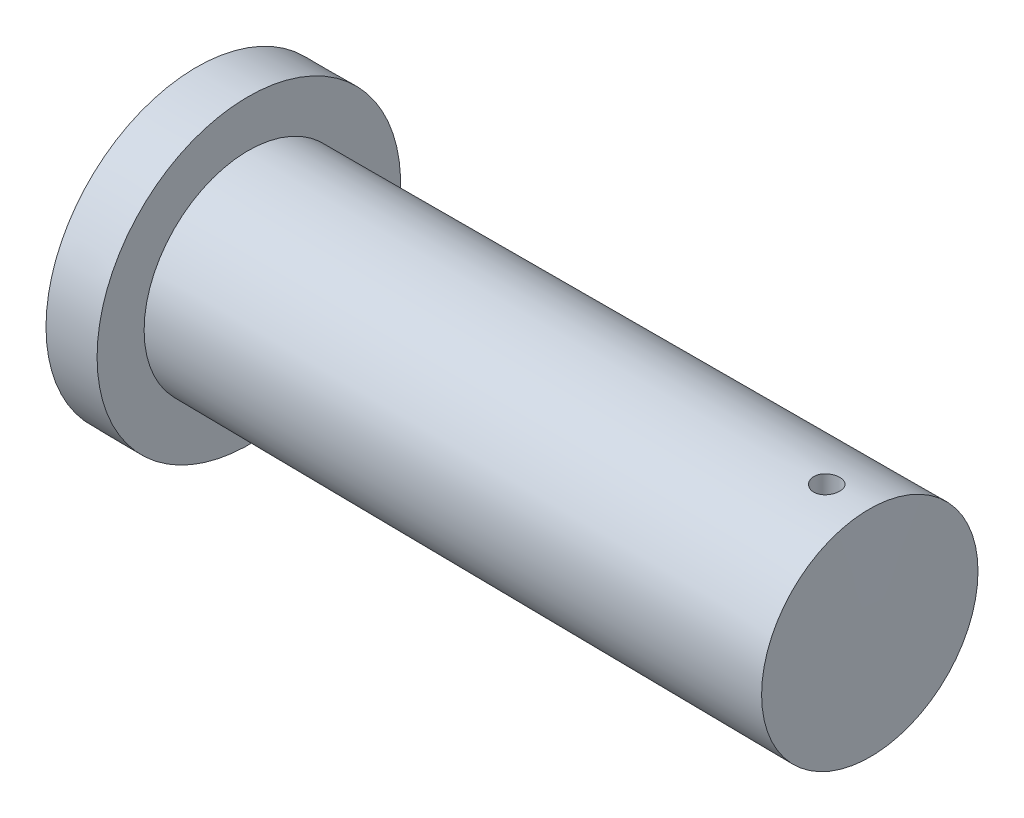
ISO-10303-21;
HEADER;
FILE_DESCRIPTION(('STEP AP214'),'2;1');
FILE_NAME('part.step','',(''),(''),'','','');
FILE_SCHEMA(('AUTOMOTIVE_DESIGN { 1 0 10303 214 1 1 1 1 }'));
ENDSEC;
DATA;
#1=APPLICATION_CONTEXT('core data for automotive mechanical design processes');
#2=APPLICATION_PROTOCOL_DEFINITION('international standard','automotive_design',2000,#1);
#3=PRODUCT_CONTEXT('',#1,'mechanical');
#4=PRODUCT('Part','Part','',(#3));
#5=PRODUCT_RELATED_PRODUCT_CATEGORY('part','',(#4));
#6=PRODUCT_DEFINITION_FORMATION('','',#4);
#7=PRODUCT_DEFINITION_CONTEXT('part definition',#1,'design');
#8=PRODUCT_DEFINITION('design','',#6,#7);
#9=PRODUCT_DEFINITION_SHAPE('','',#8);
#10=(LENGTH_UNIT() NAMED_UNIT(*) SI_UNIT(.MILLI.,.METRE.));
#11=(NAMED_UNIT(*) PLANE_ANGLE_UNIT() SI_UNIT($,.RADIAN.));
#12=(NAMED_UNIT(*) SI_UNIT($,.STERADIAN.) SOLID_ANGLE_UNIT());
#13=UNCERTAINTY_MEASURE_WITH_UNIT(LENGTH_MEASURE(1.E-05),#10,'distance_accuracy_value','');
#14=(GEOMETRIC_REPRESENTATION_CONTEXT(3) GLOBAL_UNCERTAINTY_ASSIGNED_CONTEXT((#13)) GLOBAL_UNIT_ASSIGNED_CONTEXT((#10,
#11,#12)) REPRESENTATION_CONTEXT('',''));
#15=CARTESIAN_POINT('',(0.,0.,0.));
#16=DIRECTION('',(0.,0.,1.));
#17=DIRECTION('',(1.,0.,0.));
#18=AXIS2_PLACEMENT_3D('',#15,#16,#17);
#19=CARTESIAN_POINT('',(-422.925741618143,0.,76.2880576247141));
#20=DIRECTION('',(-0.999984794635845,0.,-0.00551457134384336));
#21=DIRECTION('',(-0.00551457134384336,0.,0.999984794635845));
#22=AXIS2_PLACEMENT_3D('',#19,#20,#21);
#23=CONICAL_SURFACE('',#22,349.994678122546,1.56528172750053);
#24=CARTESIAN_POINT('',(-420.995670995671,0.,76.2987012987013));
#25=VERTEX_POINT('',#24);
#26=VERTEX_LOOP('',#25);
#27=FACE_BOUND('',#26,.T.);
#28=CARTESIAN_POINT('',(-422.925741618143,0.,76.2880576247141));
#29=DIRECTION('',(-0.999984794635845,0.,-0.00551457134384336));
#30=DIRECTION('',(-0.00551457134384336,0.,0.999984794635845));
#31=AXIS2_PLACEMENT_3D('',#28,#29,#30);
#32=CIRCLE('',#31,349.994678122546);
#33=CARTESIAN_POINT('',(-424.855812240615,0.,426.277413950727));
#34=VERTEX_POINT('',#33);
#35=EDGE_CURVE('E11',#34,#34,#32,.T.);
#36=ORIENTED_EDGE('',*,*,#35,.T.);
#37=EDGE_LOOP('',(#36));
#38=FACE_BOUND('',#37,.T.);
#39=ADVANCED_FACE('F43',(#27,#38),#23,.F.);
#40=CARTESIAN_POINT('',(-302.929390877796,0.,76.9497961238475));
#41=DIRECTION('',(0.999984794635845,0.,0.00551457134384336));
#42=DIRECTION('',(0.00551457134384336,0.,-0.999984794635845));
#43=AXIS2_PLACEMENT_3D('',#40,#41,#42);
#44=CONICAL_SURFACE('',#43,350.656426683807,0.0055145992943682);
#45=ORIENTED_EDGE('',*,*,#35,.F.);
#46=EDGE_LOOP('',(#45));
#47=FACE_BOUND('',#46,.T.);
#48=CARTESIAN_POINT('',(-302.929390877796,0.,76.9497961238475));
#49=DIRECTION('',(-0.999984794635845,0.,-0.00551457134384336));
#50=DIRECTION('',(-0.00551457134384336,0.,0.999984794635845));
#51=AXIS2_PLACEMENT_3D('',#48,#49,#50);
#52=CIRCLE('',#51,350.656426683807);
#53=CARTESIAN_POINT('',(-304.863110759921,0.,427.600890948994));
#54=VERTEX_POINT('',#53);
#55=EDGE_CURVE('E57',#54,#54,#52,.T.);
#56=ORIENTED_EDGE('',*,*,#55,.T.);
#57=EDGE_LOOP('',(#56));
#58=FACE_BOUND('',#57,.T.);
#59=ADVANCED_FACE('F66',(#47,#58),#44,.T.);
#60=CARTESIAN_POINT('',(-301.594882447724,0.,-165.04329004329));
#61=DIRECTION('',(-0.999984794635845,0.,-0.00551457134384336));
#62=DIRECTION('',(-0.00551457134384336,0.,0.999984794635845));
#63=AXIS2_PLACEMENT_3D('',#60,#61,#62);
#64=PLANE('',#63);
#65=ORIENTED_EDGE('',*,*,#55,.F.);
#66=EDGE_LOOP('',(#65));
#67=FACE_BOUND('',#66,.T.);
#68=CARTESIAN_POINT('',(-302.929390877796,0.,76.9497961238475));
#69=DIRECTION('',(-0.999984794635845,0.,-0.00551457134384336));
#70=DIRECTION('',(-0.00551457134384336,0.,0.999984794635845));
#71=AXIS2_PLACEMENT_3D('',#68,#69,#70);
#72=CIRCLE('',#71,241.996765816086);
#73=CARTESIAN_POINT('',(-304.263899307868,0.,318.942882290985));
#74=VERTEX_POINT('',#73);
#75=EDGE_CURVE('E76',#74,#74,#72,.T.);
#76=ORIENTED_EDGE('',*,*,#75,.T.);
#77=EDGE_LOOP('',(#76));
#78=FACE_BOUND('',#77,.T.);
#79=ADVANCED_FACE('F71',(#67,#78),#64,.F.);
#80=CARTESIAN_POINT('',(1147.62570713113,0.,84.9491073324333));
#81=DIRECTION('',(0.999984794635845,0.,0.00551457134384336));
#82=DIRECTION('',(0.00551457134384336,0.,-0.999984794635845));
#83=AXIS2_PLACEMENT_3D('',#80,#81,#82);
#84=CONICAL_SURFACE('',#83,249.996198658961,0.0055145992943686);
#85=CARTESIAN_POINT('',(1030.64078129818,-248.091498375832,59.2800322583241));
#86=CARTESIAN_POINT('',(1029.93428233845,-248.134547562659,59.7416354920427));
#87=CARTESIAN_POINT('',(1029.24746415687,-248.179374598095,60.2329518924908));
#88=CARTESIAN_POINT('',(1027.91754706153,-248.271249777088,61.2717942248501));
#89=CARTESIAN_POINT('',(1027.27445857254,-248.318298445764,61.8193334822415));
#90=CARTESIAN_POINT('',(1026.03613560698,-248.413240855119,62.9672035698947));
#91=CARTESIAN_POINT('',(1025.44095034355,-248.461135404751,63.5675873972236));
#92=CARTESIAN_POINT('',(1024.30335927027,-248.556291968255,64.8164195261376));
#93=CARTESIAN_POINT('',(1023.76095029683,-248.603554019893,65.4648649426515));
#94=CARTESIAN_POINT('',(1022.73288006759,-248.696030061646,66.805074594167));
#95=CARTESIAN_POINT('',(1022.24720007493,-248.741244724948,67.4968244096612));
#96=CARTESIAN_POINT('',(1021.33582728785,-248.828306206114,68.9189899788141));
#97=CARTESIAN_POINT('',(1020.91013534517,-248.870152976156,69.6494062812615));
#98=CARTESIAN_POINT('',(1020.12190435586,-248.949232148321,71.1435608711761));
#99=CARTESIAN_POINT('',(1019.7593494231,-248.986465710508,71.9072907158423));
#100=CARTESIAN_POINT('',(1019.09989338412,-249.055231739115,73.4628343664662));
#101=CARTESIAN_POINT('',(1018.80299187369,-249.086764240635,74.2546479994845));
#102=CARTESIAN_POINT('',(1018.27758299904,-249.143136537095,75.8589960811222));
#103=CARTESIAN_POINT('',(1018.04892993361,-249.167990578156,76.6714823104053));
#104=CARTESIAN_POINT('',(1017.66084564002,-249.210363627732,78.3130124355296));
#105=CARTESIAN_POINT('',(1017.50141439375,-249.227882638166,79.1420563270384));
#106=CARTESIAN_POINT('',(1017.2529574956,-249.255069391458,80.8107602211185));
#107=CARTESIAN_POINT('',(1017.16393217041,-249.264737097886,81.65042027293));
#108=CARTESIAN_POINT('',(1017.05695291063,-249.275935883188,83.3343084119552));
#109=CARTESIAN_POINT('',(1017.03899868411,-249.277466995483,84.1785364803911));
#110=CARTESIAN_POINT('',(1017.07419299005,-249.27236224424,85.8606794491351));
#111=CARTESIAN_POINT('',(1017.12693804087,-249.265772742397,86.6986029622915));
#112=CARTESIAN_POINT('',(1017.30243177813,-249.24469734746,88.3669831154871));
#113=CARTESIAN_POINT('',(1017.42518017946,-249.230211486526,89.197439785923));
#114=CARTESIAN_POINT('',(1017.73977455074,-249.193765609541,90.8449895018706));
#115=CARTESIAN_POINT('',(1017.9316203917,-249.171805607443,91.6620825723252));
#116=CARTESIAN_POINT('',(1018.38300520701,-249.121050802172,93.2771333933515));
#117=CARTESIAN_POINT('',(1018.64254432868,-249.092255984125,94.0750911022767));
#118=CARTESIAN_POINT('',(1019.22753435084,-249.028657967472,95.6465342791937));
#119=CARTESIAN_POINT('',(1019.55300807836,-248.99385268862,96.4200111642299));
#120=CARTESIAN_POINT('',(1020.2674734141,-248.919252710075,97.9367959894713));
#121=CARTESIAN_POINT('',(1020.65646499669,-248.879458012397,98.6801039418527));
#122=CARTESIAN_POINT('',(1021.49521567101,-248.796034758187,100.131407510633));
#123=CARTESIAN_POINT('',(1021.94497664785,-248.752406082738,100.839402030654));
#124=CARTESIAN_POINT('',(1022.90209432888,-248.662585346613,102.215154847148));
#125=CARTESIAN_POINT('',(1023.40945130303,-248.616393273923,102.882912955003));
#126=CARTESIAN_POINT('',(1024.48132929836,-248.522520958361,104.177328817997));
#127=CARTESIAN_POINT('',(1025.04616525248,-248.474833629669,104.803725299968));
#128=CARTESIAN_POINT('',(1026.22656476285,-248.379641463772,106.006762602422));
#129=CARTESIAN_POINT('',(1026.84212851791,-248.332136627283,106.583403227887));
#130=CARTESIAN_POINT('',(1028.11969033144,-248.238725134585,107.68288818484));
#131=CARTESIAN_POINT('',(1028.78168911161,-248.192818503232,108.205731679885));
#132=CARTESIAN_POINT('',(1030.1474858492,-248.103984927067,109.193917517247));
#133=CARTESIAN_POINT('',(1030.85128379543,-248.061057981457,109.659259874957));
#134=CARTESIAN_POINT('',(1032.29719115775,-247.979408420471,110.529995649238));
#135=CARTESIAN_POINT('',(1033.03937415724,-247.940694357811,110.935267697125));
#136=CARTESIAN_POINT('',(1034.55551489684,-247.868769615277,111.681823497928));
#137=CARTESIAN_POINT('',(1035.32947270055,-247.835558946419,112.023107122758));
#138=CARTESIAN_POINT('',(1036.90363520308,-247.775692981695,112.639183372277));
#139=CARTESIAN_POINT('',(1037.70383907881,-247.749037480481,112.913978079813));
#140=CARTESIAN_POINT('',(1039.32478847122,-247.703149126179,113.395063292955));
#141=CARTESIAN_POINT('',(1040.14553387964,-247.683916233986,113.601354159476));
#142=CARTESIAN_POINT('',(1041.79725661948,-247.653611447003,113.942991492958));
#143=CARTESIAN_POINT('',(1042.62815641597,-247.642496733746,114.078709081566));
#144=CARTESIAN_POINT('',(1044.29848987619,-247.628680828734,114.279854357403));
#145=CARTESIAN_POINT('',(1045.1379235113,-247.625979608763,114.345282280374));
#146=CARTESIAN_POINT('',(1046.8192808831,-247.629167604216,114.40537142657));
#147=CARTESIAN_POINT('',(1047.66120455353,-247.635056593069,114.400034516242));
#148=CARTESIAN_POINT('',(1049.3415227488,-247.655353027771,114.318651943578));
#149=CARTESIAN_POINT('',(1050.17991728017,-247.669760457821,114.242606412401));
#150=CARTESIAN_POINT('',(1051.84354606035,-247.706694766139,114.020872069076));
#151=CARTESIAN_POINT('',(1052.66882168573,-247.729186060822,113.875487570516));
#152=CARTESIAN_POINT('',(1054.30409131416,-247.781750081684,113.516282791883));
#153=CARTESIAN_POINT('',(1055.11408537122,-247.811822781068,113.302462753696));
#154=CARTESIAN_POINT('',(1056.71312000746,-247.878787735737,112.80795147778));
#155=CARTESIAN_POINT('',(1057.50216019757,-247.915680117547,112.527258999347));
#156=CARTESIAN_POINT('',(1059.0537708775,-247.995329667643,111.901037073139));
#157=CARTESIAN_POINT('',(1059.81634124678,-248.038086862631,111.555507330169));
#158=CARTESIAN_POINT('',(1061.31252534252,-248.128517343465,110.800667844741));
#159=CARTESIAN_POINT('',(1062.04601992733,-248.176208440927,110.391124085264));
#160=CARTESIAN_POINT('',(1063.47592476438,-248.275110065829,109.512110973387));
#161=CARTESIAN_POINT('',(1064.1723349441,-248.326320600153,109.042641503812));
#162=CARTESIAN_POINT('',(1065.52328044797,-248.430902372655,108.047057581485));
#163=CARTESIAN_POINT('',(1066.17781422502,-248.484273690545,107.520941037861));
#164=CARTESIAN_POINT('',(1067.44045836778,-248.591754268786,106.415741006521));
#165=CARTESIAN_POINT('',(1068.04856854483,-248.645863532135,105.836657303578));
#166=CARTESIAN_POINT('',(1069.21785492268,-248.753717838517,104.625698972567));
#167=CARTESIAN_POINT('',(1069.77870881617,-248.807458391622,103.993512675055));
#168=CARTESIAN_POINT('',(1070.84518337298,-248.912769863984,102.683978430597));
#169=CARTESIAN_POINT('',(1071.35080377975,-248.964340773164,102.006630273907));
#170=CARTESIAN_POINT('',(1072.30321483795,-249.063912405769,100.611514892394));
#171=CARTESIAN_POINT('',(1072.75000556593,-249.11191313384,99.8937477201627));
#172=CARTESIAN_POINT('',(1073.58154645862,-249.203036474218,98.4228365727182));
#173=CARTESIAN_POINT('',(1073.96629679835,-249.246159100285,97.6696926973033));
#174=CARTESIAN_POINT('',(1074.67066777125,-249.326313607545,96.1339849934263));
#175=CARTESIAN_POINT('',(1074.99034224225,-249.363350518568,95.3514461238688));
#176=CARTESIAN_POINT('',(1075.56261289402,-249.43036164044,93.7619160740833));
#177=CARTESIAN_POINT('',(1075.81520906062,-249.460335849798,92.9549248886932));
#178=CARTESIAN_POINT('',(1076.2514365451,-249.512395643511,91.3222953208147));
#179=CARTESIAN_POINT('',(1076.4350705641,-249.534481536838,90.4966576700242));
#180=CARTESIAN_POINT('',(1076.73200886937,-249.570156465922,88.832650679698));
#181=CARTESIAN_POINT('',(1076.84531355695,-249.583745550166,87.9942814128436));
#182=CARTESIAN_POINT('',(1077.00020088114,-249.601987744388,86.3167098428134));
#183=CARTESIAN_POINT('',(1077.042274935,-249.606702106217,85.477553544102));
#184=CARTESIAN_POINT('',(1077.05591006071,-249.607252238743,83.7986676360259));
#185=CARTESIAN_POINT('',(1077.02747146491,-249.603088051288,82.9589380293821));
#186=CARTESIAN_POINT('',(1076.90029736748,-249.585995049678,81.2849257311326));
#187=CARTESIAN_POINT('',(1076.80156313099,-249.573066393262,80.4506429417705));
#188=CARTESIAN_POINT('',(1076.5345373585,-249.538797464177,78.7934608765041));
#189=CARTESIAN_POINT('',(1076.36624581701,-249.517457190845,77.9705616014974));
#190=CARTESIAN_POINT('',(1075.96188685681,-249.467012621724,76.3441326684194));
#191=CARTESIAN_POINT('',(1075.72599860121,-249.437928864075,75.5405578152721));
#192=CARTESIAN_POINT('',(1075.18799719003,-249.372757492473,73.956189780416));
#193=CARTESIAN_POINT('',(1074.88588420373,-249.336669896425,73.1753965404762));
#194=CARTESIAN_POINT('',(1074.21760523928,-249.258460424853,71.6420101418925));
#195=CARTESIAN_POINT('',(1073.85143735423,-249.216338369692,70.8894178235921));
#196=CARTESIAN_POINT('',(1073.05766603795,-249.127189400836,69.4176650226168));
#197=CARTESIAN_POINT('',(1072.63006227043,-249.080162460292,68.6985047229714));
#198=CARTESIAN_POINT('',(1071.71387725931,-248.982185798825,67.2946527068707));
#199=CARTESIAN_POINT('',(1071.224968521,-248.931215619518,66.6101761364654));
#200=CARTESIAN_POINT('',(1070.19151992119,-248.826955870301,65.2847833685104));
#201=CARTESIAN_POINT('',(1069.64697987307,-248.773666292611,64.6438673171025));
#202=CARTESIAN_POINT('',(1068.50605440735,-248.666195346177,63.4100138703289));
#203=CARTESIAN_POINT('',(1067.90966719609,-248.612013946634,62.8170781362131));
#204=CARTESIAN_POINT('',(1066.6692068153,-248.504211194537,61.6833253069914));
#205=CARTESIAN_POINT('',(1066.02513351324,-248.450589843541,61.1425083567621));
#206=CARTESIAN_POINT('',(1064.69009729621,-248.345049801726,60.1139440854836));
#207=CARTESIAN_POINT('',(1063.99889587725,-248.29314210302,59.6265051470071));
#208=CARTESIAN_POINT('',(1062.57763541794,-248.192740131968,58.711606625803));
#209=CARTESIAN_POINT('',(1061.84757620563,-248.144245874731,58.2841473085564));
#210=CARTESIAN_POINT('',(1060.35377166586,-248.051976288947,57.4923036453198));
#211=CARTESIAN_POINT('',(1059.59002790699,-248.00820074099,57.1279163661453));
#212=CARTESIAN_POINT('',(1058.03422735368,-247.926536342181,56.4648490855532));
#213=CARTESIAN_POINT('',(1057.24217070291,-247.888647461462,56.1661687507638));
#214=CARTESIAN_POINT('',(1055.6376811076,-247.819857461932,55.6374757195697));
#215=CARTESIAN_POINT('',(1054.82531291344,-247.788936669265,55.407269088953));
#216=CARTESIAN_POINT('',(1053.18381935599,-247.734743041099,55.0160886458201));
#217=CARTESIAN_POINT('',(1052.35469395635,-247.711470222191,54.8551149835022));
#218=CARTESIAN_POINT('',(1050.68548574484,-247.673146960335,54.6035905401065));
#219=CARTESIAN_POINT('',(1049.84540097298,-247.658098009378,54.5130525363448));
#220=CARTESIAN_POINT('',(1048.16049290669,-247.636568120747,54.4031400253653));
#221=CARTESIAN_POINT('',(1047.31566969988,-247.630087025136,54.3837642063644));
#222=CARTESIAN_POINT('',(1045.63263441965,-247.625794679861,54.4162279637271));
#223=CARTESIAN_POINT('',(1044.79441392235,-247.627929726959,54.4676251023934));
#224=CARTESIAN_POINT('',(1043.12525162563,-247.640589041949,54.6404800053065));
#225=CARTESIAN_POINT('',(1042.29431021409,-247.651113754169,54.7619414801585));
#226=CARTESIAN_POINT('',(1040.64644247583,-247.680140600098,55.0738972485639));
#227=CARTESIAN_POINT('',(1039.82950343927,-247.698635052156,55.2643250406519));
#228=CARTESIAN_POINT('',(1038.21486521102,-247.742964602198,55.7127473564978));
#229=CARTESIAN_POINT('',(1037.41716170094,-247.768798035615,55.9707265577654));
#230=CARTESIAN_POINT('',(1035.58075061553,-247.836829576991,56.6508271338487));
#231=CARTESIAN_POINT('',(1034.55166042318,-247.881607835975,57.0989579070726));
#232=CARTESIAN_POINT('',(1032.55042247363,-247.980380026935,58.1072966549268));
#233=CARTESIAN_POINT('',(1031.57827479152,-248.034373971064,58.6675047773442));
#234=CARTESIAN_POINT('',(1030.64078129818,-248.091498375832,59.2800322583241));
#235=B_SPLINE_CURVE_WITH_KNOTS('',3,(#85,#86,#87,#88,#89,#90,#91,#92,#93,#94,#95,#96,#97,#98,
#99,#100,#101,#102,#103,#104,#105,#106,#107,#108,#109,#110,#111,#112,#113,#114,#115,#116,#117,
#118,#119,#120,#121,#122,#123,#124,#125,#126,#127,#128,#129,#130,#131,#132,#133,#134,#135,#136,
#137,#138,#139,#140,#141,#142,#143,#144,#145,#146,#147,#148,#149,#150,#151,#152,#153,#154,#155,
#156,#157,#158,#159,#160,#161,#162,#163,#164,#165,#166,#167,#168,#169,#170,#171,#172,#173,#174,
#175,#176,#177,#178,#179,#180,#181,#182,#183,#184,#185,#186,#187,#188,#189,#190,#191,#192,#193,
#194,#195,#196,#197,#198,#199,#200,#201,#202,#203,#204,#205,#206,#207,#208,#209,#210,#211,#212,
#213,#214,#215,#216,#217,#218,#219,#220,#221,#222,#223,#224,#225,#226,#227,#228,#229,#230,#231,
#232,#233,#234),.UNSPECIFIED.,.T.,.F.,(4,2,2,2,2,2,2,2,2,2,2,2,2,2,2,2,2,2,2,2,2,2,2,2,2,2,2,2,
2,2,2,2,2,2,2,2,2,2,2,2,2,2,2,2,2,2,2,2,2,2,2,2,2,2,2,2,2,2,2,2,2,2,2,2,2,2,2,2,2,2,2,2,2,2,4),
(0.,2.53410421440873,5.06881043384045,7.6060882868175,10.1432139536545,12.6794992557709,
15.2158205647334,17.7515027751948,20.2871693736866,22.817383298491,25.3475965612638,
27.8778215640445,30.4080361737029,32.9238721259726,35.439697831897,37.955518841549,
40.4713453261924,42.9880443006602,45.5047422593704,48.0215183056283,50.5383061490909,
53.0697133985151,55.6011305692969,58.1325870928784,60.664042938795,63.2005456997941,
65.737053538024,68.2734819067361,70.80989691199,73.3328353089103,75.8557652441881,
78.3786286364507,80.9014873490132,83.4133742692835,85.9252523113512,88.4371769606331,
90.9491130466768,93.4704566201068,95.9918051237401,98.5132467236102,101.034698569592,
103.572150379719,106.109613975278,108.647074269243,111.184527405435,113.719872676567,
116.255218482933,118.790464973158,121.325696995826,123.843366188631,126.361023514656,
128.878635530307,131.396247744488,133.907247860176,136.418241557046,138.929310018212,
141.440392225061,143.965511043381,146.490638332833,149.015853013829,151.541074714057,
154.080191119368,156.619318762925,159.158328291829,161.697324938473,164.229060515342,
166.760801584691,169.29300181519,171.825155367605,174.341550806338,176.858079525539,
179.372188089337,181.885726878432,185.24836888531,188.611015326255),.UNSPECIFIED.);
#236=CARTESIAN_POINT('',(1030.64078129818,-248.091498375832,59.2800322583241));
#237=VERTEX_POINT('',#236);
#238=EDGE_CURVE('E46',#237,#237,#235,.T.);
#239=ORIENTED_EDGE('',*,*,#238,.T.);
#240=EDGE_LOOP('',(#239));
#241=FACE_BOUND('',#240,.T.);
#242=CARTESIAN_POINT('',(1030.64078129818,248.091498375832,59.2800322583241));
#243=CARTESIAN_POINT('',(1031.34316216139,248.048697198144,58.8210986329003));
#244=CARTESIAN_POINT('',(1032.06476705145,248.00766717814,58.3916843736323));
#245=CARTESIAN_POINT('',(1033.54185226469,247.930361295696,57.5946187036782));
#246=CARTESIAN_POINT('',(1034.29733989258,247.894086465093,57.2269806930652));
#247=CARTESIAN_POINT('',(1035.83738662385,247.827396508916,56.5559743406392));
#248=CARTESIAN_POINT('',(1036.62197148985,247.79698673142,56.2526646320311));
#249=CARTESIAN_POINT('',(1038.2140106474,247.743029527281,55.7129360725381));
#250=CARTESIAN_POINT('',(1039.0214636677,247.719481719993,55.4765135113285));
#251=CARTESIAN_POINT('',(1040.65343155652,247.680020744044,55.0723009351932));
#252=CARTESIAN_POINT('',(1041.47794397883,247.664106488586,54.9045011508786));
#253=CARTESIAN_POINT('',(1043.13827539903,247.640462943957,54.6387182772917));
#254=CARTESIAN_POINT('',(1043.97409454793,247.632733764219,54.540736121491));
#255=CARTESIAN_POINT('',(1045.65085459719,247.625783108691,54.4153277372566));
#256=CARTESIAN_POINT('',(1046.49179429521,247.626559707284,54.3878855410716));
#257=CARTESIAN_POINT('',(1048.17295230068,247.636692237266,54.4037056752781));
#258=CARTESIAN_POINT('',(1049.01317061222,247.646048119647,54.4469676017683));
#259=CARTESIAN_POINT('',(1050.68393496491,247.673119564237,54.6035855507683));
#260=CARTESIAN_POINT('',(1051.51450459322,247.690805693112,54.7166952139465));
#261=CARTESIAN_POINT('',(1053.16306884005,247.73411621771,55.0119450080259));
#262=CARTESIAN_POINT('',(1053.98106348121,247.759740599137,55.1940850146177));
#263=CARTESIAN_POINT('',(1055.59874697093,247.818292370978,55.6260605147291));
#264=CARTESIAN_POINT('',(1056.39843499474,247.851220089711,55.8758990517158));
#265=CARTESIAN_POINT('',(1057.97386697362,247.923534467217,56.4414463964904));
#266=CARTESIAN_POINT('',(1058.74961084785,247.962921147797,56.757155426671));
#267=CARTESIAN_POINT('',(1060.27370652916,248.047236840736,57.4530618166142));
#268=CARTESIAN_POINT('',(1061.02198308634,248.09217979054,57.8334222822273));
#269=CARTESIAN_POINT('',(1062.48384372039,248.186343391511,58.6553502532518));
#270=CARTESIAN_POINT('',(1063.19742775622,248.235564047737,59.096917831039));
#271=CARTESIAN_POINT('',(1064.58499533817,248.33698185597,60.0381611402595));
#272=CARTESIAN_POINT('',(1065.25897746355,248.389179114631,60.5378389544897));
#273=CARTESIAN_POINT('',(1066.56266778891,248.49516318633,61.5918006621842));
#274=CARTESIAN_POINT('',(1067.19237578147,248.548950006813,62.1460848114199));
#275=CARTESIAN_POINT('',(1068.4072180947,248.657042712157,63.3092911139741));
#276=CARTESIAN_POINT('',(1068.99202671011,248.711349664819,63.9185533855436));
#277=CARTESIAN_POINT('',(1070.10827094949,248.818658438421,65.1842636516087));
#278=CARTESIAN_POINT('',(1070.6397063214,248.871660253195,65.8407118689138));
#279=CARTESIAN_POINT('',(1071.64545178752,248.97492411984,67.1962115992831));
#280=CARTESIAN_POINT('',(1072.11976157563,249.025186157029,67.8952633406063));
#281=CARTESIAN_POINT('',(1073.00786929124,249.121605246094,69.3310734044615));
#282=CARTESIAN_POINT('',(1073.42166732507,249.167762305183,70.0678316607361));
#283=CARTESIAN_POINT('',(1074.18597197642,249.254736894658,71.5742790640474));
#284=CARTESIAN_POINT('',(1074.53644470971,249.295551563229,72.3439855702567));
#285=CARTESIAN_POINT('',(1075.1712646673,249.370694591238,73.9105118692037));
#286=CARTESIAN_POINT('',(1075.4556118149,249.405022943155,74.707331693384));
#287=CARTESIAN_POINT('',(1075.95606594328,249.466248231594,76.322369996111));
#288=CARTESIAN_POINT('',(1076.17217540904,249.493145438728,77.1405876942494));
#289=CARTESIAN_POINT('',(1076.53454923989,249.53876769125,78.7925694569251));
#290=CARTESIAN_POINT('',(1076.68081401712,249.55749278486,79.6263334296989));
#291=CARTESIAN_POINT('',(1076.90166220111,249.58615779765,81.2978359734759));
#292=CARTESIAN_POINT('',(1076.9767132052,249.596154990005,82.1355118060482));
#293=CARTESIAN_POINT('',(1077.05623939099,249.607300555065,83.8142643110345));
#294=CARTESIAN_POINT('',(1077.06071487919,249.6084489662,84.6553409686634));
#295=CARTESIAN_POINT('',(1076.99905603078,249.601865625479,86.3348459520593));
#296=CARTESIAN_POINT('',(1076.93292338367,249.5941340861,87.1732743407119));
#297=CARTESIAN_POINT('',(1076.73054507807,249.570002805058,88.8414984209793));
#298=CARTESIAN_POINT('',(1076.59429949345,249.553603072529,89.6712941216888));
#299=CARTESIAN_POINT('',(1076.2533672602,249.512662516376,91.3131687249876));
#300=CARTESIAN_POINT('',(1076.04894537552,249.488153189376,92.1253034146524));
#301=CARTESIAN_POINT('',(1075.57303475161,249.431640684858,93.7294054539215));
#302=CARTESIAN_POINT('',(1075.30154623539,249.39963753226,94.5213728705782));
#303=CARTESIAN_POINT('',(1074.69346696881,249.3289990661,96.0796184364073));
#304=CARTESIAN_POINT('',(1074.35687473403,249.290363601317,96.8458959993596));
#305=CARTESIAN_POINT('',(1073.62100742466,249.207498253739,98.3474222302334));
#306=CARTESIAN_POINT('',(1073.22173202979,249.163268342359,99.0826707395895));
#307=CARTESIAN_POINT('',(1072.36132439246,249.070179993423,100.520413134282));
#308=CARTESIAN_POINT('',(1071.89991202544,249.021300908095,101.222738047257));
#309=CARTESIAN_POINT('',(1070.91994024719,248.920404384339,102.586076202518));
#310=CARTESIAN_POINT('',(1070.40138068697,248.86838693773,103.247089337087));
#311=CARTESIAN_POINT('',(1069.31072739163,248.762606252175,104.523258232557));
#312=CARTESIAN_POINT('',(1068.73863170676,248.708842949692,105.138412321824));
#313=CARTESIAN_POINT('',(1067.54489957136,248.601009842967,106.318584438187));
#314=CARTESIAN_POINT('',(1066.92326293773,248.546940037592,106.883602279948));
#315=CARTESIAN_POINT('',(1065.6307377674,248.439603420991,107.962931876392));
#316=CARTESIAN_POINT('',(1064.95956673249,248.386343703425,108.476906099319));
#317=CARTESIAN_POINT('',(1063.57611763305,248.282410825164,109.446486346845));
#318=CARTESIAN_POINT('',(1062.86383937806,248.231737676454,109.902092100973));
#319=CARTESIAN_POINT('',(1061.40317646378,248.134341671355,110.751677061388));
#320=CARTESIAN_POINT('',(1060.65479201254,248.087618792206,111.145656622738));
#321=CARTESIAN_POINT('',(1059.12718640333,247.999375586833,111.869142894138));
#322=CARTESIAN_POINT('',(1058.34796534786,247.957855243317,112.198649818481));
#323=CARTESIAN_POINT('',(1056.76537911631,247.881179151766,112.790340558592));
#324=CARTESIAN_POINT('',(1055.96205135009,247.846014082211,113.052623214964));
#325=CARTESIAN_POINT('',(1054.33587028306,247.782894629997,113.50855966931));
#326=CARTESIAN_POINT('',(1053.51301698767,247.754940245335,113.702213486361));
#327=CARTESIAN_POINT('',(1051.85371309912,247.706957463531,114.019432876897));
#328=CARTESIAN_POINT('',(1051.01726303773,247.686928757195,114.143001184617));
#329=CARTESIAN_POINT('',(1049.3367626993,247.655280435176,114.319120386881));
#330=CARTESIAN_POINT('',(1048.49271246245,247.643660775072,114.371671656567));
#331=CARTESIAN_POINT('',(1046.80881830045,247.629118722259,114.405234927979));
#332=CARTESIAN_POINT('',(1045.96898441447,247.626138182435,114.386727176423));
#333=CARTESIAN_POINT('',(1044.29384034758,247.628696202193,114.279372206711));
#334=CARTESIAN_POINT('',(1043.45853014564,247.634234722145,114.190525315766));
#335=CARTESIAN_POINT('',(1041.79840118137,247.653573337302,113.943141762205));
#336=CARTESIAN_POINT('',(1040.9735823181,247.667373352956,113.784605770641));
#337=CARTESIAN_POINT('',(1039.34029295282,247.702741512905,113.399005657861));
#338=CARTESIAN_POINT('',(1038.53182246547,247.724309664159,113.171941475254));
#339=CARTESIAN_POINT('',(1036.93823324343,247.774461011568,112.651360897553));
#340=CARTESIAN_POINT('',(1036.15307910544,247.803032890835,112.357951763861));
#341=CARTESIAN_POINT('',(1034.61027471663,247.866305087702,111.706595292137));
#342=CARTESIAN_POINT('',(1033.85262441604,247.901005394211,111.348648070893));
#343=CARTESIAN_POINT('',(1032.37008103811,247.975465096895,110.570761283956));
#344=CARTESIAN_POINT('',(1031.64518891637,248.015224640524,110.150819911361));
#345=CARTESIAN_POINT('',(1030.23320262861,248.098597723476,109.251921334585));
#346=CARTESIAN_POINT('',(1029.54610865755,248.142211282674,108.77296382605));
#347=CARTESIAN_POINT('',(1028.21068599424,248.232243797835,107.756515078926));
#348=CARTESIAN_POINT('',(1027.56259889963,248.278677243832,107.218707683774));
#349=CARTESIAN_POINT('',(1026.31396022626,248.372735985903,106.090577933767));
#350=CARTESIAN_POINT('',(1025.71340881648,248.420361286214,105.500255392239));
#351=CARTESIAN_POINT('',(1024.56401489403,248.515392321347,104.271205692585));
#352=CARTESIAN_POINT('',(1024.01517367829,248.562798050634,103.632477321127));
#353=CARTESIAN_POINT('',(1022.9730597136,248.655990539849,102.311080643844));
#354=CARTESIAN_POINT('',(1022.47978704104,248.701777297553,101.628412277616));
#355=CARTESIAN_POINT('',(1021.5504972323,248.790557236888,100.221181674534));
#356=CARTESIAN_POINT('',(1021.11470830323,248.833538960782,99.4964679880881));
#357=CARTESIAN_POINT('',(1020.30575683426,248.915244326727,98.0126575718109));
#358=CARTESIAN_POINT('',(1019.93259449362,248.953967955229,97.253560732592));
#359=CARTESIAN_POINT('',(1019.25160734101,249.026012228271,95.7063717580137));
#360=CARTESIAN_POINT('',(1018.94378126068,249.059332977693,94.9182801858691));
#361=CARTESIAN_POINT('',(1018.39571343059,249.119587349611,93.3186994951455));
#362=CARTESIAN_POINT('',(1018.15547137495,249.146521001014,92.5072104824798));
#363=CARTESIAN_POINT('',(1017.74512474588,249.193116304355,90.8697447068853));
#364=CARTESIAN_POINT('',(1017.57475870468,249.212805036932,90.04383423637));
#365=CARTESIAN_POINT('',(1017.30412633133,249.244474165878,88.380459800331));
#366=CARTESIAN_POINT('',(1017.2038598617,249.256454577367,87.5429958574721));
#367=CARTESIAN_POINT('',(1017.07417874858,249.27235402874,85.8625765862578));
#368=CARTESIAN_POINT('',(1017.04475964864,249.27627357567,85.0196216066459));
#369=CARTESIAN_POINT('',(1017.05698160754,249.275937382142,83.3342306215659));
#370=CARTESIAN_POINT('',(1017.09862238928,249.271681673565,82.4917946140867));
#371=CARTESIAN_POINT('',(1017.25225061882,249.255163756002,80.8178817574252));
#372=CARTESIAN_POINT('',(1017.36386968284,249.242943461407,79.9863706552608));
#373=CARTESIAN_POINT('',(1017.65629813994,249.210892914641,78.3357557331349));
#374=CARTESIAN_POINT('',(1017.8371074924,249.191062666938,77.5166519058905));
#375=CARTESIAN_POINT('',(1018.26664189522,249.144363741224,75.8964603955375));
#376=CARTESIAN_POINT('',(1018.51538219558,249.117493482838,75.0953768016006));
#377=CARTESIAN_POINT('',(1019.07895111115,249.057498062041,73.5170587584035));
#378=CARTESIAN_POINT('',(1019.3937790599,249.024372962708,72.7398240687309));
#379=CARTESIAN_POINT('',(1020.08800002651,248.952753426969,71.2130068729861));
#380=CARTESIAN_POINT('',(1020.46752865396,248.91424774432,70.4634865545134));
#381=CARTESIAN_POINT('',(1021.28799244507,248.833041009459,68.9990372800077));
#382=CARTESIAN_POINT('',(1021.72893106484,248.790339721161,68.2841102739118));
#383=CARTESIAN_POINT('',(1022.66867189857,248.702027876645,66.8944772236495));
#384=CARTESIAN_POINT('',(1023.16742095391,248.65642001023,66.21973507915));
#385=CARTESIAN_POINT('',(1024.21942707238,248.563606036985,64.9146365545919));
#386=CARTESIAN_POINT('',(1024.77267230433,248.516400278515,64.284270591146));
#387=CARTESIAN_POINT('',(1026.1446945899,248.404200713583,62.8472265217658));
#388=CARTESIAN_POINT('',(1026.98589173229,248.33909820738,62.0617861410984));
#389=CARTESIAN_POINT('',(1028.75296693228,248.212055900917,60.5924516916026));
#390=CARTESIAN_POINT('',(1029.67884555036,248.150116121593,59.9085582949732));
#391=CARTESIAN_POINT('',(1030.64078129818,248.091498375832,59.2800322583241));
#392=B_SPLINE_CURVE_WITH_KNOTS('',3,(#242,#243,#244,#245,#246,#247,#248,#249,#250,#251,#252,
#253,#254,#255,#256,#257,#258,#259,#260,#261,#262,#263,#264,#265,#266,#267,#268,#269,#270,#271,
#272,#273,#274,#275,#276,#277,#278,#279,#280,#281,#282,#283,#284,#285,#286,#287,#288,#289,#290,
#291,#292,#293,#294,#295,#296,#297,#298,#299,#300,#301,#302,#303,#304,#305,#306,#307,#308,#309,
#310,#311,#312,#313,#314,#315,#316,#317,#318,#319,#320,#321,#322,#323,#324,#325,#326,#327,#328,
#329,#330,#331,#332,#333,#334,#335,#336,#337,#338,#339,#340,#341,#342,#343,#344,#345,#346,#347,
#348,#349,#350,#351,#352,#353,#354,#355,#356,#357,#358,#359,#360,#361,#362,#363,#364,#365,#366,
#367,#368,#369,#370,#371,#372,#373,#374,#375,#376,#377,#378,#379,#380,#381,#382,#383,#384,#385,
#386,#387,#388,#389,#390,#391),.UNSPECIFIED.,.T.,.F.,(4,2,2,2,2,2,2,2,2,2,2,2,2,2,2,2,2,2,2,2,2,
2,2,2,2,2,2,2,2,2,2,2,2,2,2,2,2,2,2,2,2,2,2,2,2,2,2,2,2,2,2,2,2,2,2,2,2,2,2,2,2,2,2,2,2,2,2,2,2,
2,2,2,2,2,4),(0.,2.51935213830495,5.03925005344492,7.56143499752333,10.0834800049908,
12.6051658398314,15.1268853893317,17.648034060447,20.1691683294066,22.6814607206157,
25.1937485877247,27.706149416438,30.2185587276853,32.7374031937615,35.2562506383298,
37.7751883916936,40.2941379441074,42.8299071400048,45.3656883104536,47.9014830681733,
50.4372733701842,52.9744165352751,55.5115626427346,58.0486163458801,60.5856550785398,
63.1059176527188,65.6261692818334,68.1463606083847,70.6665492796334,73.177062557623,
75.6875674875092,78.1981296659785,80.7087046724413,83.2310023727959,85.7533066495693,
88.2757028233692,90.7981083211475,93.3362154248368,95.8743342892766,98.4124385296059,
100.950534333653,103.484876657268,106.019218276422,108.553461016917,111.087690370412,
113.604822583778,116.121943087786,118.639039354431,121.156137876061,123.669195679846,
126.182248935986,128.695375452836,131.208514930784,133.735888210916,136.26327047538,
138.790716111764,141.318165222627,143.855364127172,146.392571104227,148.92972882272,
151.466875058068,153.994439021435,156.521998027137,159.049398039473,161.576788195695,
164.090983962953,166.605178254365,169.119937428815,171.634671244521,174.154742127152,
176.67495489469,179.192868357033,181.710236377266,185.160556522179,188.610899505764),.UNSPECIFIED.);
#393=CARTESIAN_POINT('',(1030.64078129818,248.091498375832,59.2800322583241));
#394=VERTEX_POINT('',#393);
#395=EDGE_CURVE('E83',#394,#394,#392,.T.);
#396=ORIENTED_EDGE('',*,*,#395,.T.);
#397=EDGE_LOOP('',(#396));
#398=FACE_BOUND('',#397,.T.);
#399=ORIENTED_EDGE('',*,*,#75,.F.);
#400=EDGE_LOOP('',(#399));
#401=FACE_BOUND('',#400,.T.);
#402=CARTESIAN_POINT('',(1147.62570713113,0.,84.9491073324333));
#403=DIRECTION('',(-0.999984794635845,0.,-0.00551457134384336));
#404=DIRECTION('',(-0.00551457134384336,0.,0.999984794635845));
#405=AXIS2_PLACEMENT_3D('',#402,#403,#404);
#406=CIRCLE('',#405,249.996198658961);
#407=CARTESIAN_POINT('',(1146.24708525794,0.,334.941504708157));
#408=VERTEX_POINT('',#407);
#409=EDGE_CURVE('E80',#408,#408,#406,.T.);
#410=ORIENTED_EDGE('',*,*,#409,.T.);
#411=EDGE_LOOP('',(#410));
#412=FACE_BOUND('',#411,.T.);
#413=ADVANCED_FACE('F89',(#241,#398,#401,#412),#84,.T.);
#414=CARTESIAN_POINT('',(1149.00432900433,0.,84.9567099567099));
#415=DIRECTION('',(-0.999984794635845,0.,-0.00551457134384336));
#416=DIRECTION('',(-0.00551457134384336,0.,0.999984794635845));
#417=AXIS2_PLACEMENT_3D('',#414,#415,#416);
#418=CONICAL_SURFACE('',#417,2.22044604925031E-13,1.56528172750053);
#419=ORIENTED_EDGE('',*,*,#409,.F.);
#420=EDGE_LOOP('',(#419));
#421=FACE_BOUND('',#420,.T.);
#422=CARTESIAN_POINT('',(1149.00432900433,0.,84.9567099567099));
#423=VERTEX_POINT('',#422);
#424=VERTEX_LOOP('',#423);
#425=FACE_BOUND('',#424,.T.);
#426=ADVANCED_FACE('F96',(#421,#425),#418,.T.);
#427=CARTESIAN_POINT('',(1047.0500818806,-350.656426683807,84.394467438036));
#428=DIRECTION('',(0.,1.,0.));
#429=DIRECTION('',(0.,0.,1.));
#430=AXIS2_PLACEMENT_3D('',#427,#428,#429);
#431=CYLINDRICAL_SURFACE('',#430,30.);
#432=ORIENTED_EDGE('',*,*,#395,.F.);
#433=EDGE_LOOP('',(#432));
#434=FACE_BOUND('',#433,.T.);
#435=ORIENTED_EDGE('',*,*,#238,.F.);
#436=EDGE_LOOP('',(#435));
#437=FACE_BOUND('',#436,.T.);
#438=ADVANCED_FACE('F93',(#434,#437),#431,.F.);
#439=CLOSED_SHELL('',(#39,#59,#79,#413,#426,#438));
#440=MANIFOLD_SOLID_BREP('B2',#439);
#441=ADVANCED_BREP_SHAPE_REPRESENTATION('',(#18,#440),#14);
#442=SHAPE_DEFINITION_REPRESENTATION(#9,#441);
ENDSEC;
END-ISO-10303-21;
